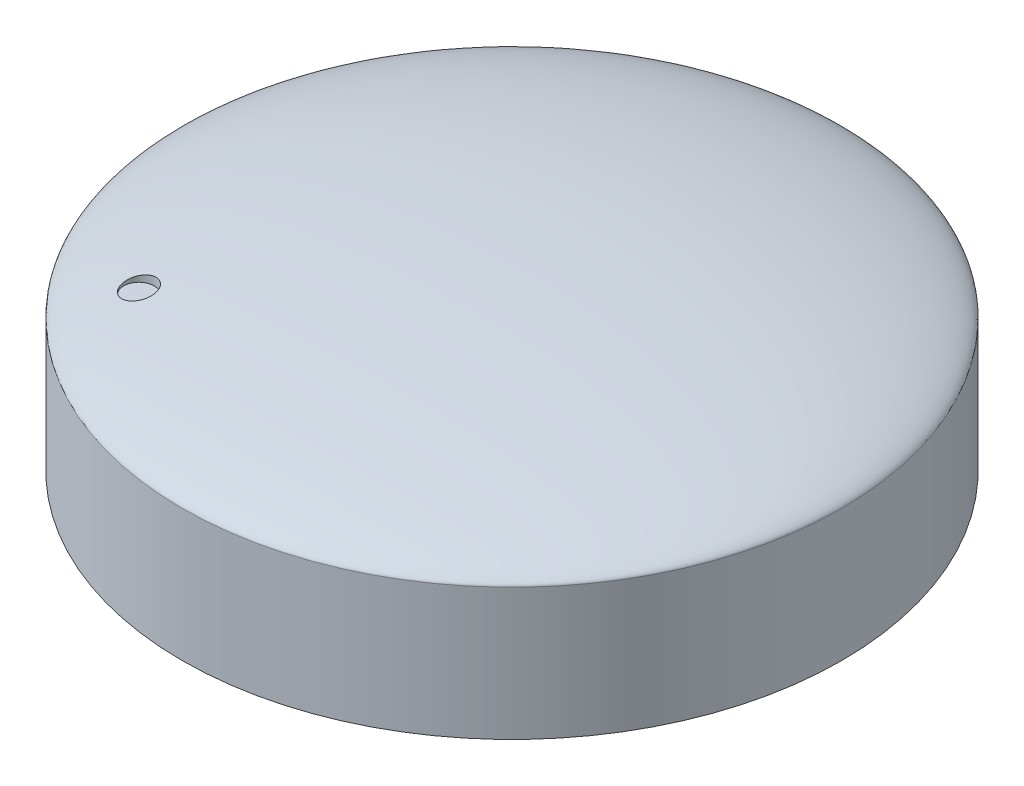
ISO-10303-21;
HEADER;
FILE_DESCRIPTION(('STEP AP214'),'2;1');
FILE_NAME('part.step','',(''),(''),'','','');
FILE_SCHEMA(('AUTOMOTIVE_DESIGN { 1 0 10303 214 1 1 1 1 }'));
ENDSEC;
DATA;
#1=APPLICATION_CONTEXT('core data for automotive mechanical design processes');
#2=APPLICATION_PROTOCOL_DEFINITION('international standard','automotive_design',2000,#1);
#3=PRODUCT_CONTEXT('',#1,'mechanical');
#4=PRODUCT('Part','Part','',(#3));
#5=PRODUCT_RELATED_PRODUCT_CATEGORY('part','',(#4));
#6=PRODUCT_DEFINITION_FORMATION('','',#4);
#7=PRODUCT_DEFINITION_CONTEXT('part definition',#1,'design');
#8=PRODUCT_DEFINITION('design','',#6,#7);
#9=PRODUCT_DEFINITION_SHAPE('','',#8);
#10=(LENGTH_UNIT() NAMED_UNIT(*) SI_UNIT(.MILLI.,.METRE.));
#11=(NAMED_UNIT(*) PLANE_ANGLE_UNIT() SI_UNIT($,.RADIAN.));
#12=(NAMED_UNIT(*) SI_UNIT($,.STERADIAN.) SOLID_ANGLE_UNIT());
#13=UNCERTAINTY_MEASURE_WITH_UNIT(LENGTH_MEASURE(1.E-05),#10,'distance_accuracy_value','');
#14=(GEOMETRIC_REPRESENTATION_CONTEXT(3) GLOBAL_UNCERTAINTY_ASSIGNED_CONTEXT((#13)) GLOBAL_UNIT_ASSIGNED_CONTEXT((#10,
#11,#12)) REPRESENTATION_CONTEXT('',''));
#15=CARTESIAN_POINT('',(0.,0.,0.));
#16=DIRECTION('',(0.,0.,1.));
#17=DIRECTION('',(1.,0.,0.));
#18=AXIS2_PLACEMENT_3D('',#15,#16,#17);
#19=CARTESIAN_POINT('',(0.,18.,0.));
#20=DIRECTION('',(0.,-1.,0.));
#21=DIRECTION('',(0.,0.,-1.));
#22=AXIS2_PLACEMENT_3D('',#19,#20,#21);
#23=CYLINDRICAL_SURFACE('',#22,32.5);
#24=CARTESIAN_POINT('',(0.,13.,0.));
#25=DIRECTION('',(0.,-1.,0.));
#26=DIRECTION('',(0.,0.,-1.));
#27=AXIS2_PLACEMENT_3D('',#24,#25,#26);
#28=CIRCLE('',#27,32.5);
#29=CARTESIAN_POINT('',(0.,13.,-32.5));
#30=VERTEX_POINT('',#29);
#31=EDGE_CURVE('E50',#30,#30,#28,.T.);
#32=ORIENTED_EDGE('',*,*,#31,.T.);
#33=EDGE_LOOP('',(#32));
#34=FACE_BOUND('',#33,.T.);
#35=CARTESIAN_POINT('',(0.,0.,0.));
#36=DIRECTION('',(0.,1.,0.));
#37=DIRECTION('',(0.,0.,1.));
#38=AXIS2_PLACEMENT_3D('',#35,#36,#37);
#39=CIRCLE('',#38,32.5);
#40=CARTESIAN_POINT('',(0.,0.,32.5));
#41=VERTEX_POINT('',#40);
#42=EDGE_CURVE('E11',#41,#41,#39,.T.);
#43=ORIENTED_EDGE('',*,*,#42,.T.);
#44=EDGE_LOOP('',(#43));
#45=FACE_BOUND('',#44,.T.);
#46=ADVANCED_FACE('F38',(#34,#45),#23,.T.);
#47=CARTESIAN_POINT('',(0.,0.,0.));
#48=DIRECTION('',(0.,1.,0.));
#49=DIRECTION('',(0.,0.,1.));
#50=AXIS2_PLACEMENT_3D('',#47,#48,#49);
#51=PLANE('',#50);
#52=CARTESIAN_POINT('',(0.,0.,0.));
#53=DIRECTION('',(0.,1.,0.));
#54=DIRECTION('',(0.,0.,1.));
#55=AXIS2_PLACEMENT_3D('',#52,#53,#54);
#56=CIRCLE('',#55,14.75);
#57=CARTESIAN_POINT('',(0.,0.,14.75));
#58=VERTEX_POINT('',#57);
#59=EDGE_CURVE('E85',#58,#58,#56,.T.);
#60=ORIENTED_EDGE('',*,*,#59,.T.);
#61=EDGE_LOOP('',(#60));
#62=FACE_BOUND('',#61,.T.);
#63=ORIENTED_EDGE('',*,*,#42,.F.);
#64=EDGE_LOOP('',(#63));
#65=FACE_BOUND('',#64,.T.);
#66=ADVANCED_FACE('F57',(#62,#65),#51,.F.);
#67=CARTESIAN_POINT('',(-32.5,13.,0.));
#68=CARTESIAN_POINT('',(-32.5,14.1722581139411,0.));
#69=CARTESIAN_POINT('',(-21.6014057846311,18.,0.));
#70=CARTESIAN_POINT('',(0.,18.,0.));
#71=B_SPLINE_CURVE_WITH_KNOTS('',3,(#67,#68,#69,#70),.UNSPECIFIED.,.F.,.F.,(4,4),(0.,1.),.UNSPECIFIED.);
#72=CARTESIAN_POINT('',(0.,0.,0.));
#73=DIRECTION('',(0.,-1.,0.));
#74=AXIS1_PLACEMENT('',#72,#73);
#75=SURFACE_OF_REVOLUTION('',#71,#74);
#76=CARTESIAN_POINT('',(-18.3847763108501,15.3178889184671,19.8847763108503));
#77=CARTESIAN_POINT('',(-18.2987632585082,15.3327973920855,19.8847699581625));
#78=CARTESIAN_POINT('',(-18.2128506587158,15.3489027045465,19.8773423537602));
#79=CARTESIAN_POINT('',(-18.0862198889652,15.3743932334097,19.8553931483871));
#80=CARTESIAN_POINT('',(-18.044341352754,15.3831216931655,19.8462606932558));
#81=CARTESIAN_POINT('',(-17.9615526747876,15.4009654916304,19.824468508689));
#82=CARTESIAN_POINT('',(-17.9206433593897,15.4100811431891,19.8118058790957));
#83=CARTESIAN_POINT('',(-17.8000416596796,15.437848486441,19.7687390533134));
#84=CARTESIAN_POINT('',(-17.7222278246721,15.4569705850384,19.7332124537901));
#85=CARTESIAN_POINT('',(-17.5738711596839,15.4958750881922,19.6495631547168));
#86=CARTESIAN_POINT('',(-17.5033291064268,15.5156575629873,19.6014391115304));
#87=CARTESIAN_POINT('',(-17.4039614157355,15.5455365973528,19.5205001914421));
#88=CARTESIAN_POINT('',(-17.371694527518,15.5556073422142,19.4918110176033));
#89=CARTESIAN_POINT('',(-17.3097731098238,15.5756950569184,19.4317845699298));
#90=CARTESIAN_POINT('',(-17.2801161006966,15.5857120691245,19.4004498663256));
#91=CARTESIAN_POINT('',(-17.1953205113146,15.6156014239503,19.3027206774002));
#92=CARTESIAN_POINT('',(-17.1443366503782,15.6353183177058,19.232584208762));
#93=CARTESIAN_POINT('',(-17.0550137415181,15.6737963459927,19.0842436258182));
#94=CARTESIAN_POINT('',(-17.0167050216748,15.6925550986418,19.006020741025));
#95=CARTESIAN_POINT('',(-16.9540995166274,15.7285657817584,18.8438138653312));
#96=CARTESIAN_POINT('',(-16.929801904606,15.7458178010895,18.7598302147098));
#97=CARTESIAN_POINT('',(-16.8963525949821,15.7781086765051,18.5897300701164));
#98=CARTESIAN_POINT('',(-16.8869968650587,15.7931747462727,18.503658894419));
#99=CARTESIAN_POINT('',(-16.8832582012211,15.8209554374323,18.3308104037206));
#100=CARTESIAN_POINT('',(-16.8888733511811,15.8336703595255,18.2440331805038));
#101=CARTESIAN_POINT('',(-16.914793207001,15.856124851011,18.0743833344551));
#102=CARTESIAN_POINT('',(-16.9347570528537,15.8659261320883,17.9914668111394));
#103=CARTESIAN_POINT('',(-16.9885605245993,15.882663079549,17.8299581431845));
#104=CARTESIAN_POINT('',(-17.0223982817943,15.8895991316019,17.7513654177827));
#105=CARTESIAN_POINT('',(-17.1021433874938,15.9002862529024,17.6025881770173));
#106=CARTESIAN_POINT('',(-17.1477654008082,15.9041047616494,17.5322554746385));
#107=CARTESIAN_POINT('',(-17.2501360573922,15.908705436926,17.4001061501954));
#108=CARTESIAN_POINT('',(-17.3068836979714,15.9094878769475,17.3382887615476));
#109=CARTESIAN_POINT('',(-17.4290689466395,15.9080044875814,17.2257089994775));
#110=CARTESIAN_POINT('',(-17.494386393188,15.905777438079,17.1748155934603));
#111=CARTESIAN_POINT('',(-17.6323749918775,15.8984048111107,17.0845105538279));
#112=CARTESIAN_POINT('',(-17.7050460325318,15.8932592778861,17.0450987461773));
#113=CARTESIAN_POINT('',(-17.8557407750718,15.8801816452939,16.9787508294288));
#114=CARTESIAN_POINT('',(-17.9337707516232,15.8722462329634,16.9518296414149));
#115=CARTESIAN_POINT('',(-18.0928942831659,15.853801486843,16.9111583356651));
#116=CARTESIAN_POINT('',(-18.173988011167,15.8432920075116,16.8974089628998));
#117=CARTESIAN_POINT('',(-18.3381769663391,15.8198027305622,16.883205221006));
#118=CARTESIAN_POINT('',(-18.4212841915308,15.806789488171,16.882945475915));
#119=CARTESIAN_POINT('',(-18.5860661191794,15.7787308413476,16.8960466198038));
#120=CARTESIAN_POINT('',(-18.6677406684668,15.7636852211091,16.9094089562214));
#121=CARTESIAN_POINT('',(-18.8292868207416,15.7315832845395,16.9496825862704));
#122=CARTESIAN_POINT('',(-18.9090768126672,15.7144894182541,16.9768912500707));
#123=CARTESIAN_POINT('',(-19.0627572634793,15.6790123714542,17.0441127901307));
#124=CARTESIAN_POINT('',(-19.1366470049222,15.6606290346549,17.0841272205597));
#125=CARTESIAN_POINT('',(-19.2781517743355,15.6226217120373,17.1768065568635));
#126=CARTESIAN_POINT('',(-19.3455903189106,15.6029792098402,17.229733456809));
#127=CARTESIAN_POINT('',(-19.4704491238249,15.5633610585657,17.3462167187685));
#128=CARTESIAN_POINT('',(-19.5278684385284,15.543385378237,17.4097740830002));
#129=CARTESIAN_POINT('',(-19.6317840908612,15.5033877838493,17.5466531564513));
#130=CARTESIAN_POINT('',(-19.6781278337211,15.4833686787329,17.620091643356));
#131=CARTESIAN_POINT('',(-19.757542867024,15.4441376494401,17.7740285414039));
#132=CARTESIAN_POINT('',(-19.7906139361703,15.424925738727,17.8545270702325));
#133=CARTESIAN_POINT('',(-19.8423401285089,15.3879643611581,18.0200773703264));
#134=CARTESIAN_POINT('',(-19.8610383038697,15.3702106702166,18.1051147212521));
#135=CARTESIAN_POINT('',(-19.8834602175679,15.3366965823188,18.2775310718195));
#136=CARTESIAN_POINT('',(-19.8871853215568,15.3209360037034,18.3649098571739));
#137=CARTESIAN_POINT('',(-19.8794166935905,15.292268931868,18.5376763198534));
#138=CARTESIAN_POINT('',(-19.8682240192572,15.279311931286,18.6230690490811));
#139=CARTESIAN_POINT('',(-19.831264978176,15.2563556392287,18.7910553959186));
#140=CARTESIAN_POINT('',(-19.8055011241353,15.2463558382559,18.8736494935324));
#141=CARTESIAN_POINT('',(-19.7409495127836,15.2299595816094,19.0311755401074));
#142=CARTESIAN_POINT('',(-19.7025560484309,15.2234680959437,19.106259216671));
#143=CARTESIAN_POINT('',(-19.6136164686004,15.2139247621558,19.2490825177256));
#144=CARTESIAN_POINT('',(-19.5630727457389,15.210872237509,19.3168235843101));
#145=CARTESIAN_POINT('',(-19.4525895235319,15.2083629389166,19.4414459889175));
#146=CARTESIAN_POINT('',(-19.3928930519708,15.2088250222795,19.4985413893893));
#147=CARTESIAN_POINT('',(-19.2650067386571,15.2131346498221,19.6021364904612));
#148=CARTESIAN_POINT('',(-19.1968151301955,15.2169828992254,19.6486339813365));
#149=CARTESIAN_POINT('',(-19.0542591745129,15.2278862455794,19.729576071246));
#150=CARTESIAN_POINT('',(-18.9799225225344,15.2349275338977,19.7640714510552));
#151=CARTESIAN_POINT('',(-18.8269960269955,15.2519392502902,19.8204184621064));
#152=CARTESIAN_POINT('',(-18.7484112729503,15.2619062339663,19.8422848720075));
#153=CARTESIAN_POINT('',(-18.6219120170872,15.2797735248297,19.8666852526351));
#154=CARTESIAN_POINT('',(-18.5746570694653,15.2868413347605,19.873470774203));
#155=CARTESIAN_POINT('',(-18.4798499601424,15.3017806355793,19.8825180154675));
#156=CARTESIAN_POINT('',(-18.4322978040754,15.309652111276,19.8847798206572));
#157=CARTESIAN_POINT('',(-18.3847763108501,15.3178889184671,19.8847763108503));
#158=B_SPLINE_CURVE_WITH_KNOTS('',3,(#76,#77,#78,#79,#80,#81,#82,#83,#84,#85,#86,#87,#88,#89,
#90,#91,#92,#93,#94,#95,#96,#97,#98,#99,#100,#101,#102,#103,#104,#105,#106,#107,#108,#109,#110,
#111,#112,#113,#114,#115,#116,#117,#118,#119,#120,#121,#122,#123,#124,#125,#126,#127,#128,#129,
#130,#131,#132,#133,#134,#135,#136,#137,#138,#139,#140,#141,#142,#143,#144,#145,#146,#147,#148,
#149,#150,#151,#152,#153,#154,#155,#156,#157),.UNSPECIFIED.,.T.,.F.,(4,2,2,2,2,2,2,2,2,2,2,2,2,
2,2,2,2,2,2,2,2,2,2,2,2,2,2,2,2,2,2,2,2,2,2,2,2,2,2,2,4),(0.,0.261675688957035,
0.392779527001473,0.523991390295828,0.785655730912937,1.04734799188247,1.18021652329207,
1.31295742155698,1.57835788509096,1.84438886148802,2.11040413737773,2.37275490883623,
2.63507210358213,2.8913554797688,3.14760434809595,3.39815101884478,3.64867511959638,
3.89600159282837,4.14332431694735,4.39094173272872,4.63857315241146,4.88977634119831,
5.14100622479341,5.39787487534433,5.65477471253701,5.91739838630515,6.18004683365191,
6.44612857842386,6.71221475941798,6.97750077342392,7.2427625908921,7.50275136639761,
7.76269532215629,8.01519169394249,8.26763838507385,8.51427476853528,8.76096253014583,
9.00659349114682,9.25193642468951,9.39651279025063,9.5410864234543),.UNSPECIFIED.);
#159=CARTESIAN_POINT('',(-18.3847763108501,15.3178889184671,19.8847763108503));
#160=VERTEX_POINT('',#159);
#161=EDGE_CURVE('E41',#160,#160,#158,.T.);
#162=ORIENTED_EDGE('',*,*,#161,.F.);
#163=EDGE_LOOP('',(#162));
#164=FACE_BOUND('',#163,.T.);
#165=CARTESIAN_POINT('',(0.,18.,0.));
#166=VERTEX_POINT('',#165);
#167=VERTEX_LOOP('',#166);
#168=FACE_BOUND('',#167,.T.);
#169=ORIENTED_EDGE('',*,*,#31,.F.);
#170=EDGE_LOOP('',(#169));
#171=FACE_BOUND('',#170,.T.);
#172=ADVANCED_FACE('F53',(#164,#168,#171),#75,.F.);
#173=CARTESIAN_POINT('',(-18.3847763108501,15.,18.3847763108503));
#174=DIRECTION('',(0.,1.,0.));
#175=DIRECTION('',(0.,0.,1.));
#176=AXIS2_PLACEMENT_3D('',#173,#174,#175);
#177=CYLINDRICAL_SURFACE('',#176,1.5);
#178=ORIENTED_EDGE('',*,*,#161,.T.);
#179=EDGE_LOOP('',(#178));
#180=FACE_BOUND('',#179,.T.);
#181=CARTESIAN_POINT('',(-18.3847763108501,15.,18.3847763108503));
#182=DIRECTION('',(0.,1.,0.));
#183=DIRECTION('',(0.,0.,1.));
#184=AXIS2_PLACEMENT_3D('',#181,#182,#183);
#185=CIRCLE('',#184,1.5);
#186=CARTESIAN_POINT('',(-18.3847763108501,15.,19.8847763108503));
#187=VERTEX_POINT('',#186);
#188=EDGE_CURVE('E64',#187,#187,#185,.T.);
#189=ORIENTED_EDGE('',*,*,#188,.F.);
#190=EDGE_LOOP('',(#189));
#191=FACE_BOUND('',#190,.T.);
#192=ADVANCED_FACE('F56',(#180,#191),#177,.F.);
#193=CARTESIAN_POINT('',(-18.3847763108501,15.,18.3847763108503));
#194=DIRECTION('',(0.,1.,0.));
#195=DIRECTION('',(0.,0.,1.));
#196=AXIS2_PLACEMENT_3D('',#193,#194,#195);
#197=PLANE('',#196);
#198=ORIENTED_EDGE('',*,*,#188,.T.);
#199=EDGE_LOOP('',(#198));
#200=FACE_BOUND('',#199,.T.);
#201=ADVANCED_FACE('F97',(#200),#197,.T.);
#202=CARTESIAN_POINT('',(0.,-12.,0.));
#203=DIRECTION('',(0.,1.,0.));
#204=DIRECTION('',(0.,0.,1.));
#205=AXIS2_PLACEMENT_3D('',#202,#203,#204);
#206=CYLINDRICAL_SURFACE('',#205,14.75);
#207=CARTESIAN_POINT('',(0.,-12.,0.));
#208=DIRECTION('',(0.,1.,0.));
#209=DIRECTION('',(0.,0.,1.));
#210=AXIS2_PLACEMENT_3D('',#207,#208,#209);
#211=CIRCLE('',#210,14.75);
#212=CARTESIAN_POINT('',(0.,-12.,14.75));
#213=VERTEX_POINT('',#212);
#214=EDGE_CURVE('E89',#213,#213,#211,.T.);
#215=ORIENTED_EDGE('',*,*,#214,.T.);
#216=EDGE_LOOP('',(#215));
#217=FACE_BOUND('',#216,.T.);
#218=ORIENTED_EDGE('',*,*,#59,.F.);
#219=EDGE_LOOP('',(#218));
#220=FACE_BOUND('',#219,.T.);
#221=ADVANCED_FACE('F104',(#217,#220),#206,.T.);
#222=CARTESIAN_POINT('',(0.,-12.,0.));
#223=DIRECTION('',(0.,1.,0.));
#224=DIRECTION('',(0.,0.,1.));
#225=AXIS2_PLACEMENT_3D('',#222,#223,#224);
#226=PLANE('',#225);
#227=ORIENTED_EDGE('',*,*,#214,.F.);
#228=EDGE_LOOP('',(#227));
#229=FACE_BOUND('',#228,.T.);
#230=ADVANCED_FACE('F109',(#229),#226,.F.);
#231=CLOSED_SHELL('',(#46,#66,#172,#192,#201,#221,#230));
#232=MANIFOLD_SOLID_BREP('B2',#231);
#233=ADVANCED_BREP_SHAPE_REPRESENTATION('',(#18,#232),#14);
#234=SHAPE_DEFINITION_REPRESENTATION(#9,#233);
ENDSEC;
END-ISO-10303-21;
